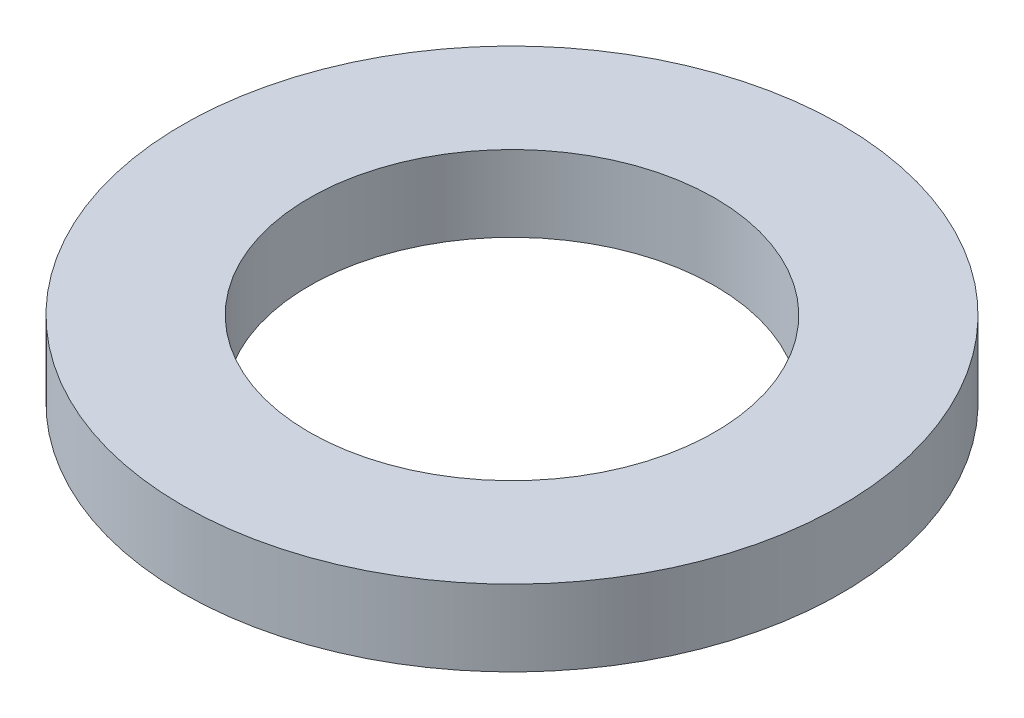
ISO-10303-21;
HEADER;
FILE_DESCRIPTION(('STEP AP214'),'2;1');
FILE_NAME('part.step','',(''),(''),'','','');
FILE_SCHEMA(('AUTOMOTIVE_DESIGN { 1 0 10303 214 1 1 1 1 }'));
ENDSEC;
DATA;
#1=APPLICATION_CONTEXT('core data for automotive mechanical design processes');
#2=APPLICATION_PROTOCOL_DEFINITION('international standard','automotive_design',2000,#1);
#3=PRODUCT_CONTEXT('',#1,'mechanical');
#4=PRODUCT('Part','Part','',(#3));
#5=PRODUCT_RELATED_PRODUCT_CATEGORY('part','',(#4));
#6=PRODUCT_DEFINITION_FORMATION('','',#4);
#7=PRODUCT_DEFINITION_CONTEXT('part definition',#1,'design');
#8=PRODUCT_DEFINITION('design','',#6,#7);
#9=PRODUCT_DEFINITION_SHAPE('','',#8);
#10=(LENGTH_UNIT() NAMED_UNIT(*) SI_UNIT(.MILLI.,.METRE.));
#11=(NAMED_UNIT(*) PLANE_ANGLE_UNIT() SI_UNIT($,.RADIAN.));
#12=(NAMED_UNIT(*) SI_UNIT($,.STERADIAN.) SOLID_ANGLE_UNIT());
#13=UNCERTAINTY_MEASURE_WITH_UNIT(LENGTH_MEASURE(1.E-05),#10,'distance_accuracy_value','');
#14=(GEOMETRIC_REPRESENTATION_CONTEXT(3) GLOBAL_UNCERTAINTY_ASSIGNED_CONTEXT((#13)) GLOBAL_UNIT_ASSIGNED_CONTEXT((#10,
#11,#12)) REPRESENTATION_CONTEXT('',''));
#15=CARTESIAN_POINT('',(0.,0.,0.));
#16=DIRECTION('',(0.,0.,1.));
#17=DIRECTION('',(1.,0.,0.));
#18=AXIS2_PLACEMENT_3D('',#15,#16,#17);
#19=CARTESIAN_POINT('',(0.,15.,0.));
#20=DIRECTION('',(0.,-1.,0.));
#21=DIRECTION('',(0.,0.,-1.));
#22=AXIS2_PLACEMENT_3D('',#19,#20,#21);
#23=CYLINDRICAL_SURFACE('',#22,65.);
#24=CARTESIAN_POINT('',(0.,15.,0.));
#25=DIRECTION('',(0.,1.,0.));
#26=DIRECTION('',(0.,0.,1.));
#27=AXIS2_PLACEMENT_3D('',#24,#25,#26);
#28=CIRCLE('',#27,65.);
#29=CARTESIAN_POINT('',(0.,15.,65.));
#30=VERTEX_POINT('',#29);
#31=EDGE_CURVE('E10',#30,#30,#28,.T.);
#32=ORIENTED_EDGE('',*,*,#31,.F.);
#33=EDGE_LOOP('',(#32));
#34=FACE_BOUND('',#33,.T.);
#35=CARTESIAN_POINT('',(0.,0.,0.));
#36=DIRECTION('',(0.,1.,0.));
#37=DIRECTION('',(0.,0.,1.));
#38=AXIS2_PLACEMENT_3D('',#35,#36,#37);
#39=CIRCLE('',#38,65.);
#40=CARTESIAN_POINT('',(0.,0.,65.));
#41=VERTEX_POINT('',#40);
#42=EDGE_CURVE('E37',#41,#41,#39,.T.);
#43=ORIENTED_EDGE('',*,*,#42,.T.);
#44=EDGE_LOOP('',(#43));
#45=FACE_BOUND('',#44,.T.);
#46=ADVANCED_FACE('F40',(#34,#45),#23,.T.);
#47=CARTESIAN_POINT('',(0.,15.,0.));
#48=DIRECTION('',(0.,1.,0.));
#49=DIRECTION('',(0.,0.,1.));
#50=AXIS2_PLACEMENT_3D('',#47,#48,#49);
#51=PLANE('',#50);
#52=CARTESIAN_POINT('',(0.,15.,0.));
#53=DIRECTION('',(0.,1.,0.));
#54=DIRECTION('',(0.,0.,1.));
#55=AXIS2_PLACEMENT_3D('',#52,#53,#54);
#56=CIRCLE('',#55,40.);
#57=CARTESIAN_POINT('',(0.,15.,40.));
#58=VERTEX_POINT('',#57);
#59=EDGE_CURVE('E50',#58,#58,#56,.T.);
#60=ORIENTED_EDGE('',*,*,#59,.F.);
#61=EDGE_LOOP('',(#60));
#62=FACE_BOUND('',#61,.T.);
#63=ORIENTED_EDGE('',*,*,#31,.T.);
#64=EDGE_LOOP('',(#63));
#65=FACE_BOUND('',#64,.T.);
#66=ADVANCED_FACE('F59',(#62,#65),#51,.T.);
#67=CARTESIAN_POINT('',(0.,0.,0.));
#68=DIRECTION('',(0.,1.,0.));
#69=DIRECTION('',(0.,0.,1.));
#70=AXIS2_PLACEMENT_3D('',#67,#68,#69);
#71=PLANE('',#70);
#72=CARTESIAN_POINT('',(0.,0.,0.));
#73=DIRECTION('',(0.,1.,0.));
#74=DIRECTION('',(0.,0.,1.));
#75=AXIS2_PLACEMENT_3D('',#72,#73,#74);
#76=CIRCLE('',#75,40.);
#77=CARTESIAN_POINT('',(0.,0.,40.));
#78=VERTEX_POINT('',#77);
#79=EDGE_CURVE('E47',#78,#78,#76,.T.);
#80=ORIENTED_EDGE('',*,*,#79,.T.);
#81=EDGE_LOOP('',(#80));
#82=FACE_BOUND('',#81,.T.);
#83=ORIENTED_EDGE('',*,*,#42,.F.);
#84=EDGE_LOOP('',(#83));
#85=FACE_BOUND('',#84,.T.);
#86=ADVANCED_FACE('F58',(#82,#85),#71,.F.);
#87=CARTESIAN_POINT('',(0.,15.,0.));
#88=DIRECTION('',(0.,-1.,0.));
#89=DIRECTION('',(0.,0.,-1.));
#90=AXIS2_PLACEMENT_3D('',#87,#88,#89);
#91=CYLINDRICAL_SURFACE('',#90,40.);
#92=ORIENTED_EDGE('',*,*,#59,.T.);
#93=EDGE_LOOP('',(#92));
#94=FACE_BOUND('',#93,.T.);
#95=ORIENTED_EDGE('',*,*,#79,.F.);
#96=EDGE_LOOP('',(#95));
#97=FACE_BOUND('',#96,.T.);
#98=ADVANCED_FACE('F54',(#94,#97),#91,.F.);
#99=CLOSED_SHELL('',(#46,#66,#86,#98));
#100=MANIFOLD_SOLID_BREP('B2',#99);
#101=ADVANCED_BREP_SHAPE_REPRESENTATION('',(#18,#100),#14);
#102=SHAPE_DEFINITION_REPRESENTATION(#9,#101);
ENDSEC;
END-ISO-10303-21;
